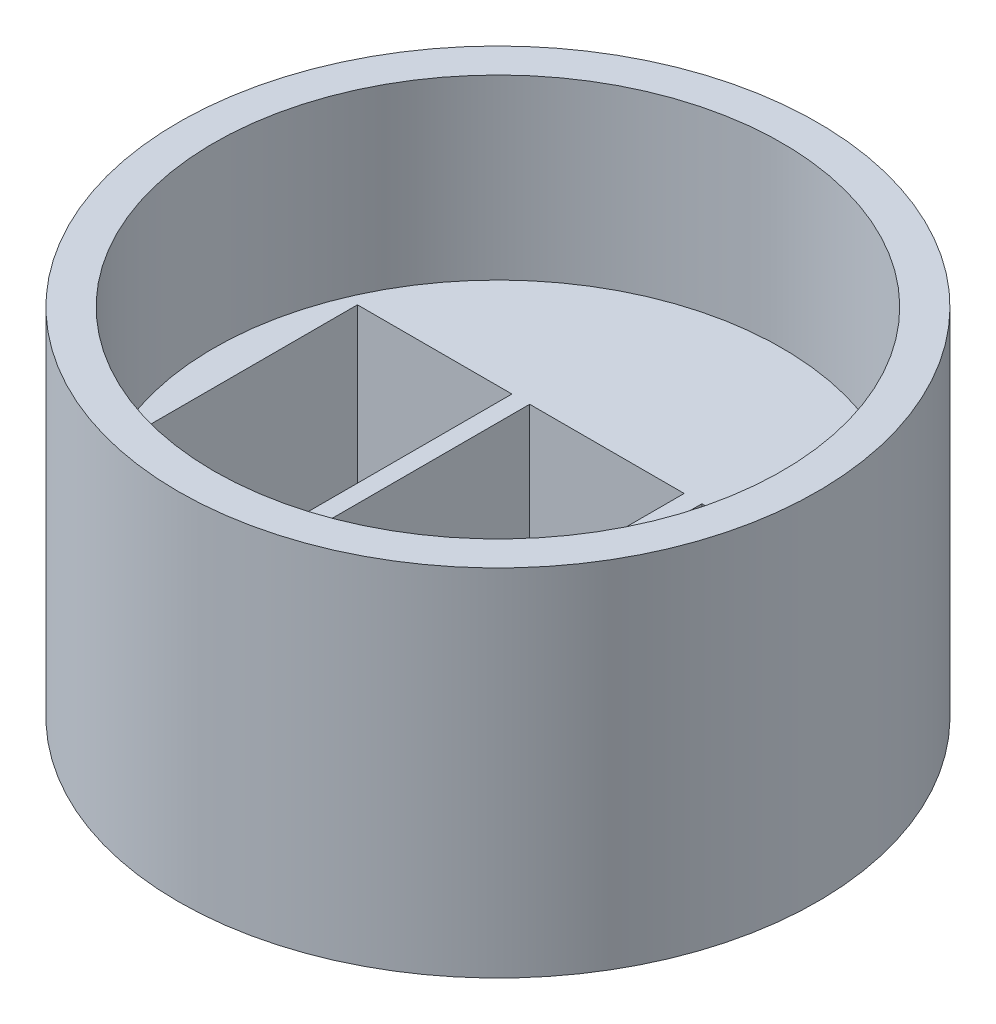
ISO-10303-21;
HEADER;
FILE_DESCRIPTION(('STEP AP214'),'2;1');
FILE_NAME('part.step','',(''),(''),'','','');
FILE_SCHEMA(('AUTOMOTIVE_DESIGN { 1 0 10303 214 1 1 1 1 }'));
ENDSEC;
DATA;
#1=APPLICATION_CONTEXT('core data for automotive mechanical design processes');
#2=APPLICATION_PROTOCOL_DEFINITION('international standard','automotive_design',2000,#1);
#3=PRODUCT_CONTEXT('',#1,'mechanical');
#4=PRODUCT('Part','Part','',(#3));
#5=PRODUCT_RELATED_PRODUCT_CATEGORY('part','',(#4));
#6=PRODUCT_DEFINITION_FORMATION('','',#4);
#7=PRODUCT_DEFINITION_CONTEXT('part definition',#1,'design');
#8=PRODUCT_DEFINITION('design','',#6,#7);
#9=PRODUCT_DEFINITION_SHAPE('','',#8);
#10=(LENGTH_UNIT() NAMED_UNIT(*) SI_UNIT(.MILLI.,.METRE.));
#11=(NAMED_UNIT(*) PLANE_ANGLE_UNIT() SI_UNIT($,.RADIAN.));
#12=(NAMED_UNIT(*) SI_UNIT($,.STERADIAN.) SOLID_ANGLE_UNIT());
#13=UNCERTAINTY_MEASURE_WITH_UNIT(LENGTH_MEASURE(1.E-05),#10,'distance_accuracy_value','');
#14=(GEOMETRIC_REPRESENTATION_CONTEXT(3) GLOBAL_UNCERTAINTY_ASSIGNED_CONTEXT((#13)) GLOBAL_UNIT_ASSIGNED_CONTEXT((#10,
#11,#12)) REPRESENTATION_CONTEXT('',''));
#15=CARTESIAN_POINT('',(0.,0.,0.));
#16=DIRECTION('',(0.,0.,1.));
#17=DIRECTION('',(1.,0.,0.));
#18=AXIS2_PLACEMENT_3D('',#15,#16,#17);
#19=CARTESIAN_POINT('',(0.,10.,0.));
#20=DIRECTION('',(0.,-1.,0.));
#21=DIRECTION('',(0.,0.,-1.));
#22=AXIS2_PLACEMENT_3D('',#19,#20,#21);
#23=CYLINDRICAL_SURFACE('',#22,9.);
#24=CARTESIAN_POINT('',(0.,10.,0.));
#25=DIRECTION('',(0.,1.,0.));
#26=DIRECTION('',(0.,0.,1.));
#27=AXIS2_PLACEMENT_3D('',#24,#25,#26);
#28=CIRCLE('',#27,9.);
#29=CARTESIAN_POINT('',(0.,10.,9.));
#30=VERTEX_POINT('',#29);
#31=EDGE_CURVE('E11',#30,#30,#28,.T.);
#32=ORIENTED_EDGE('',*,*,#31,.F.);
#33=EDGE_LOOP('',(#32));
#34=FACE_BOUND('',#33,.T.);
#35=CARTESIAN_POINT('',(0.,0.,0.));
#36=DIRECTION('',(0.,1.,0.));
#37=DIRECTION('',(0.,0.,1.));
#38=AXIS2_PLACEMENT_3D('',#35,#36,#37);
#39=CIRCLE('',#38,9.);
#40=CARTESIAN_POINT('',(0.,0.,9.));
#41=VERTEX_POINT('',#40);
#42=EDGE_CURVE('E38',#41,#41,#39,.T.);
#43=ORIENTED_EDGE('',*,*,#42,.T.);
#44=EDGE_LOOP('',(#43));
#45=FACE_BOUND('',#44,.T.);
#46=ADVANCED_FACE('F35',(#34,#45),#23,.T.);
#47=CARTESIAN_POINT('',(0.,10.,0.));
#48=DIRECTION('',(0.,1.,0.));
#49=DIRECTION('',(0.,0.,1.));
#50=AXIS2_PLACEMENT_3D('',#47,#48,#49);
#51=PLANE('',#50);
#52=CARTESIAN_POINT('',(0.,10.,0.));
#53=DIRECTION('',(0.,1.,0.));
#54=DIRECTION('',(0.,0.,1.));
#55=AXIS2_PLACEMENT_3D('',#52,#53,#54);
#56=CIRCLE('',#55,8.);
#57=CARTESIAN_POINT('',(0.,10.,8.));
#58=VERTEX_POINT('',#57);
#59=EDGE_CURVE('E217',#58,#58,#56,.T.);
#60=ORIENTED_EDGE('',*,*,#59,.F.);
#61=EDGE_LOOP('',(#60));
#62=FACE_BOUND('',#61,.T.);
#63=ORIENTED_EDGE('',*,*,#31,.T.);
#64=EDGE_LOOP('',(#63));
#65=FACE_BOUND('',#64,.T.);
#66=ADVANCED_FACE('F232',(#62,#65),#51,.T.);
#67=CARTESIAN_POINT('',(0.,0.,0.));
#68=DIRECTION('',(0.,1.,0.));
#69=DIRECTION('',(0.,0.,1.));
#70=AXIS2_PLACEMENT_3D('',#67,#68,#69);
#71=PLANE('',#70);
#72=DIRECTION('',(-1.,0.,0.));
#73=VECTOR('',#72,1.);
#74=CARTESIAN_POINT('',(7.01889440762769,0.,-3.075));
#75=LINE('',#74,#73);
#76=CARTESIAN_POINT('',(7.01889440762769,0.,-3.075));
#77=VERTEX_POINT('',#76);
#78=CARTESIAN_POINT('',(2.66889440762769,0.,-3.075));
#79=VERTEX_POINT('',#78);
#80=EDGE_CURVE('E131',#77,#79,#75,.T.);
#81=ORIENTED_EDGE('',*,*,#80,.T.);
#82=DIRECTION('',(0.,0.,1.));
#83=VECTOR('',#82,1.);
#84=CARTESIAN_POINT('',(2.66889440762769,0.,3.075));
#85=LINE('',#84,#83);
#86=CARTESIAN_POINT('',(2.66889440762769,0.,3.075));
#87=VERTEX_POINT('',#86);
#88=EDGE_CURVE('E125',#79,#87,#85,.T.);
#89=ORIENTED_EDGE('',*,*,#88,.T.);
#90=DIRECTION('',(1.,0.,0.));
#91=VECTOR('',#90,1.);
#92=CARTESIAN_POINT('',(7.01889440762769,0.,3.075));
#93=LINE('',#92,#91);
#94=CARTESIAN_POINT('',(7.01889440762769,0.,3.075));
#95=VERTEX_POINT('',#94);
#96=EDGE_CURVE('E134',#87,#95,#93,.T.);
#97=ORIENTED_EDGE('',*,*,#96,.T.);
#98=DIRECTION('',(0.,0.,-1.));
#99=VECTOR('',#98,1.);
#100=CARTESIAN_POINT('',(7.01889440762769,0.,3.075));
#101=LINE('',#100,#99);
#102=EDGE_CURVE('E49',#95,#77,#101,.T.);
#103=ORIENTED_EDGE('',*,*,#102,.T.);
#104=EDGE_LOOP('',(#81,#89,#97,#103));
#105=FACE_BOUND('',#104,.T.);
#106=DIRECTION('',(1.,0.,0.));
#107=VECTOR('',#106,1.);
#108=CARTESIAN_POINT('',(-7.03110559237231,0.,3.075));
#109=LINE('',#108,#107);
#110=CARTESIAN_POINT('',(-7.03110559237231,0.,3.075));
#111=VERTEX_POINT('',#110);
#112=CARTESIAN_POINT('',(-2.68110559237231,0.,3.075));
#113=VERTEX_POINT('',#112);
#114=EDGE_CURVE('E170',#111,#113,#109,.T.);
#115=ORIENTED_EDGE('',*,*,#114,.T.);
#116=DIRECTION('',(0.,0.,-1.));
#117=VECTOR('',#116,1.);
#118=CARTESIAN_POINT('',(-2.68110559237231,0.,-3.075));
#119=LINE('',#118,#117);
#120=CARTESIAN_POINT('',(-2.68110559237231,0.,-3.075));
#121=VERTEX_POINT('',#120);
#122=EDGE_CURVE('E160',#113,#121,#119,.T.);
#123=ORIENTED_EDGE('',*,*,#122,.T.);
#124=DIRECTION('',(-1.,0.,0.));
#125=VECTOR('',#124,1.);
#126=CARTESIAN_POINT('',(-7.03110559237231,0.,-3.075));
#127=LINE('',#126,#125);
#128=CARTESIAN_POINT('',(-7.03110559237231,0.,-3.075));
#129=VERTEX_POINT('',#128);
#130=EDGE_CURVE('E163',#121,#129,#127,.T.);
#131=ORIENTED_EDGE('',*,*,#130,.T.);
#132=DIRECTION('',(0.,0.,1.));
#133=VECTOR('',#132,1.);
#134=CARTESIAN_POINT('',(-7.03110559237231,0.,-3.075));
#135=LINE('',#134,#133);
#136=EDGE_CURVE('E167',#129,#111,#135,.T.);
#137=ORIENTED_EDGE('',*,*,#136,.T.);
#138=EDGE_LOOP('',(#115,#123,#131,#137));
#139=FACE_BOUND('',#138,.T.);
#140=DIRECTION('',(-1.,0.,0.));
#141=VECTOR('',#140,1.);
#142=CARTESIAN_POINT('',(2.16889440762769,0.,-3.075));
#143=LINE('',#142,#141);
#144=CARTESIAN_POINT('',(2.16889440762769,0.,-3.075));
#145=VERTEX_POINT('',#144);
#146=CARTESIAN_POINT('',(-2.18110559237231,0.,-3.075));
#147=VERTEX_POINT('',#146);
#148=EDGE_CURVE('E202',#145,#147,#143,.T.);
#149=ORIENTED_EDGE('',*,*,#148,.T.);
#150=DIRECTION('',(0.,0.,1.));
#151=VECTOR('',#150,1.);
#152=CARTESIAN_POINT('',(-2.18110559237231,0.,3.075));
#153=LINE('',#152,#151);
#154=CARTESIAN_POINT('',(-2.18110559237231,0.,3.075));
#155=VERTEX_POINT('',#154);
#156=EDGE_CURVE('E192',#147,#155,#153,.T.);
#157=ORIENTED_EDGE('',*,*,#156,.T.);
#158=DIRECTION('',(1.,0.,0.));
#159=VECTOR('',#158,1.);
#160=CARTESIAN_POINT('',(2.16889440762769,0.,3.075));
#161=LINE('',#160,#159);
#162=CARTESIAN_POINT('',(2.16889440762769,0.,3.075));
#163=VERTEX_POINT('',#162);
#164=EDGE_CURVE('E195',#155,#163,#161,.T.);
#165=ORIENTED_EDGE('',*,*,#164,.T.);
#166=DIRECTION('',(0.,0.,-1.));
#167=VECTOR('',#166,1.);
#168=CARTESIAN_POINT('',(2.16889440762769,0.,3.075));
#169=LINE('',#168,#167);
#170=EDGE_CURVE('E199',#163,#145,#169,.T.);
#171=ORIENTED_EDGE('',*,*,#170,.T.);
#172=EDGE_LOOP('',(#149,#157,#165,#171));
#173=FACE_BOUND('',#172,.T.);
#174=ORIENTED_EDGE('',*,*,#42,.F.);
#175=EDGE_LOOP('',(#174));
#176=FACE_BOUND('',#175,.T.);
#177=ADVANCED_FACE('F138',(#105,#139,#173,#176),#71,.F.);
#178=CARTESIAN_POINT('',(0.,5.,0.));
#179=DIRECTION('',(0.,1.,0.));
#180=DIRECTION('',(0.,0.,1.));
#181=AXIS2_PLACEMENT_3D('',#178,#179,#180);
#182=CYLINDRICAL_SURFACE('',#181,8.);
#183=CARTESIAN_POINT('',(0.,5.,0.));
#184=DIRECTION('',(0.,1.,0.));
#185=DIRECTION('',(0.,0.,1.));
#186=AXIS2_PLACEMENT_3D('',#183,#184,#185);
#187=CIRCLE('',#186,8.);
#188=CARTESIAN_POINT('',(0.,5.,8.));
#189=VERTEX_POINT('',#188);
#190=EDGE_CURVE('E224',#189,#189,#187,.T.);
#191=ORIENTED_EDGE('',*,*,#190,.F.);
#192=EDGE_LOOP('',(#191));
#193=FACE_BOUND('',#192,.T.);
#194=ORIENTED_EDGE('',*,*,#59,.T.);
#195=EDGE_LOOP('',(#194));
#196=FACE_BOUND('',#195,.T.);
#197=ADVANCED_FACE('F230',(#193,#196),#182,.F.);
#198=CARTESIAN_POINT('',(0.,5.,0.));
#199=DIRECTION('',(0.,1.,0.));
#200=DIRECTION('',(0.,0.,1.));
#201=AXIS2_PLACEMENT_3D('',#198,#199,#200);
#202=PLANE('',#201);
#203=DIRECTION('',(0.,0.,1.));
#204=VECTOR('',#203,1.);
#205=CARTESIAN_POINT('',(2.66889440762769,5.,3.075));
#206=LINE('',#205,#204);
#207=CARTESIAN_POINT('',(2.66889440762769,5.,-3.075));
#208=VERTEX_POINT('',#207);
#209=CARTESIAN_POINT('',(2.66889440762769,5.,3.075));
#210=VERTEX_POINT('',#209);
#211=EDGE_CURVE('E57',#208,#210,#206,.T.);
#212=ORIENTED_EDGE('',*,*,#211,.F.);
#213=DIRECTION('',(-1.,0.,0.));
#214=VECTOR('',#213,1.);
#215=CARTESIAN_POINT('',(7.01889440762769,5.,-3.075));
#216=LINE('',#215,#214);
#217=CARTESIAN_POINT('',(7.01889440762769,5.,-3.075));
#218=VERTEX_POINT('',#217);
#219=EDGE_CURVE('E141',#218,#208,#216,.T.);
#220=ORIENTED_EDGE('',*,*,#219,.F.);
#221=DIRECTION('',(0.,0.,-1.));
#222=VECTOR('',#221,1.);
#223=CARTESIAN_POINT('',(7.01889440762769,5.,3.075));
#224=LINE('',#223,#222);
#225=CARTESIAN_POINT('',(7.01889440762769,5.,3.075));
#226=VERTEX_POINT('',#225);
#227=EDGE_CURVE('E144',#226,#218,#224,.T.);
#228=ORIENTED_EDGE('',*,*,#227,.F.);
#229=DIRECTION('',(1.,0.,0.));
#230=VECTOR('',#229,1.);
#231=CARTESIAN_POINT('',(7.01889440762769,5.,3.075));
#232=LINE('',#231,#230);
#233=EDGE_CURVE('E150',#210,#226,#232,.T.);
#234=ORIENTED_EDGE('',*,*,#233,.F.);
#235=EDGE_LOOP('',(#212,#220,#228,#234));
#236=FACE_BOUND('',#235,.T.);
#237=DIRECTION('',(0.,0.,-1.));
#238=VECTOR('',#237,1.);
#239=CARTESIAN_POINT('',(-2.68110559237231,5.,-3.075));
#240=LINE('',#239,#238);
#241=CARTESIAN_POINT('',(-2.68110559237231,5.,3.075));
#242=VERTEX_POINT('',#241);
#243=CARTESIAN_POINT('',(-2.68110559237231,5.,-3.075));
#244=VERTEX_POINT('',#243);
#245=EDGE_CURVE('E156',#242,#244,#240,.T.);
#246=ORIENTED_EDGE('',*,*,#245,.F.);
#247=DIRECTION('',(1.,0.,0.));
#248=VECTOR('',#247,1.);
#249=CARTESIAN_POINT('',(-7.03110559237231,5.,3.075));
#250=LINE('',#249,#248);
#251=CARTESIAN_POINT('',(-7.03110559237231,5.,3.075));
#252=VERTEX_POINT('',#251);
#253=EDGE_CURVE('E164',#252,#242,#250,.T.);
#254=ORIENTED_EDGE('',*,*,#253,.F.);
#255=DIRECTION('',(0.,0.,1.));
#256=VECTOR('',#255,1.);
#257=CARTESIAN_POINT('',(-7.03110559237231,5.,-3.075));
#258=LINE('',#257,#256);
#259=CARTESIAN_POINT('',(-7.03110559237231,5.,-3.075));
#260=VERTEX_POINT('',#259);
#261=EDGE_CURVE('E178',#260,#252,#258,.T.);
#262=ORIENTED_EDGE('',*,*,#261,.F.);
#263=DIRECTION('',(-1.,0.,0.));
#264=VECTOR('',#263,1.);
#265=CARTESIAN_POINT('',(-7.03110559237231,5.,-3.075));
#266=LINE('',#265,#264);
#267=EDGE_CURVE('E175',#244,#260,#266,.T.);
#268=ORIENTED_EDGE('',*,*,#267,.F.);
#269=EDGE_LOOP('',(#246,#254,#262,#268));
#270=FACE_BOUND('',#269,.T.);
#271=DIRECTION('',(0.,0.,1.));
#272=VECTOR('',#271,1.);
#273=CARTESIAN_POINT('',(-2.18110559237231,5.,3.075));
#274=LINE('',#273,#272);
#275=CARTESIAN_POINT('',(-2.18110559237231,5.,-3.075));
#276=VERTEX_POINT('',#275);
#277=CARTESIAN_POINT('',(-2.18110559237231,5.,3.075));
#278=VERTEX_POINT('',#277);
#279=EDGE_CURVE('E185',#276,#278,#274,.T.);
#280=ORIENTED_EDGE('',*,*,#279,.F.);
#281=DIRECTION('',(-1.,0.,0.));
#282=VECTOR('',#281,1.);
#283=CARTESIAN_POINT('',(2.16889440762769,5.,-3.075));
#284=LINE('',#283,#282);
#285=CARTESIAN_POINT('',(2.16889440762769,5.,-3.075));
#286=VERTEX_POINT('',#285);
#287=EDGE_CURVE('E196',#286,#276,#284,.T.);
#288=ORIENTED_EDGE('',*,*,#287,.F.);
#289=DIRECTION('',(0.,0.,-1.));
#290=VECTOR('',#289,1.);
#291=CARTESIAN_POINT('',(2.16889440762769,5.,3.075));
#292=LINE('',#291,#290);
#293=CARTESIAN_POINT('',(2.16889440762769,5.,3.075));
#294=VERTEX_POINT('',#293);
#295=EDGE_CURVE('E210',#294,#286,#292,.T.);
#296=ORIENTED_EDGE('',*,*,#295,.F.);
#297=DIRECTION('',(1.,0.,0.));
#298=VECTOR('',#297,1.);
#299=CARTESIAN_POINT('',(2.16889440762769,5.,3.075));
#300=LINE('',#299,#298);
#301=EDGE_CURVE('E207',#278,#294,#300,.T.);
#302=ORIENTED_EDGE('',*,*,#301,.F.);
#303=EDGE_LOOP('',(#280,#288,#296,#302));
#304=FACE_BOUND('',#303,.T.);
#305=ORIENTED_EDGE('',*,*,#190,.T.);
#306=EDGE_LOOP('',(#305));
#307=FACE_BOUND('',#306,.T.);
#308=ADVANCED_FACE('F247',(#236,#270,#304,#307),#202,.T.);
#309=CARTESIAN_POINT('',(-2.18110559237231,0.,3.075));
#310=DIRECTION('',(-1.,0.,0.));
#311=DIRECTION('',(0.,0.,1.));
#312=AXIS2_PLACEMENT_3D('',#309,#310,#311);
#313=PLANE('',#312);
#314=ORIENTED_EDGE('',*,*,#279,.T.);
#315=DIRECTION('',(0.,1.,0.));
#316=VECTOR('',#315,1.);
#317=CARTESIAN_POINT('',(-2.18110559237231,0.,3.075));
#318=LINE('',#317,#316);
#319=EDGE_CURVE('E205',#155,#278,#318,.T.);
#320=ORIENTED_EDGE('',*,*,#319,.F.);
#321=ORIENTED_EDGE('',*,*,#156,.F.);
#322=DIRECTION('',(0.,1.,0.));
#323=VECTOR('',#322,1.);
#324=CARTESIAN_POINT('',(-2.18110559237231,0.,-3.075));
#325=LINE('',#324,#323);
#326=EDGE_CURVE('E215',#147,#276,#325,.T.);
#327=ORIENTED_EDGE('',*,*,#326,.T.);
#328=EDGE_LOOP('',(#314,#320,#321,#327));
#329=FACE_BOUND('',#328,.T.);
#330=ADVANCED_FACE('F253',(#329),#313,.F.);
#331=CARTESIAN_POINT('',(2.16889440762769,0.,-3.075));
#332=DIRECTION('',(0.,0.,-1.));
#333=DIRECTION('',(-1.,0.,0.));
#334=AXIS2_PLACEMENT_3D('',#331,#332,#333);
#335=PLANE('',#334);
#336=ORIENTED_EDGE('',*,*,#287,.T.);
#337=ORIENTED_EDGE('',*,*,#326,.F.);
#338=ORIENTED_EDGE('',*,*,#148,.F.);
#339=DIRECTION('',(0.,1.,0.));
#340=VECTOR('',#339,1.);
#341=CARTESIAN_POINT('',(2.16889440762769,0.,-3.075));
#342=LINE('',#341,#340);
#343=EDGE_CURVE('E218',#145,#286,#342,.T.);
#344=ORIENTED_EDGE('',*,*,#343,.T.);
#345=EDGE_LOOP('',(#336,#337,#338,#344));
#346=FACE_BOUND('',#345,.T.);
#347=ADVANCED_FACE('F257',(#346),#335,.F.);
#348=CARTESIAN_POINT('',(2.16889440762769,0.,3.075));
#349=DIRECTION('',(1.,0.,0.));
#350=DIRECTION('',(0.,0.,-1.));
#351=AXIS2_PLACEMENT_3D('',#348,#349,#350);
#352=PLANE('',#351);
#353=ORIENTED_EDGE('',*,*,#295,.T.);
#354=ORIENTED_EDGE('',*,*,#343,.F.);
#355=ORIENTED_EDGE('',*,*,#170,.F.);
#356=DIRECTION('',(0.,1.,0.));
#357=VECTOR('',#356,1.);
#358=CARTESIAN_POINT('',(2.16889440762769,0.,3.075));
#359=LINE('',#358,#357);
#360=EDGE_CURVE('E220',#163,#294,#359,.T.);
#361=ORIENTED_EDGE('',*,*,#360,.T.);
#362=EDGE_LOOP('',(#353,#354,#355,#361));
#363=FACE_BOUND('',#362,.T.);
#364=ADVANCED_FACE('F263',(#363),#352,.F.);
#365=CARTESIAN_POINT('',(2.16889440762769,0.,3.075));
#366=DIRECTION('',(0.,0.,1.));
#367=DIRECTION('',(1.,0.,0.));
#368=AXIS2_PLACEMENT_3D('',#365,#366,#367);
#369=PLANE('',#368);
#370=ORIENTED_EDGE('',*,*,#301,.T.);
#371=ORIENTED_EDGE('',*,*,#360,.F.);
#372=ORIENTED_EDGE('',*,*,#164,.F.);
#373=ORIENTED_EDGE('',*,*,#319,.T.);
#374=EDGE_LOOP('',(#370,#371,#372,#373));
#375=FACE_BOUND('',#374,.T.);
#376=ADVANCED_FACE('F259',(#375),#369,.F.);
#377=CARTESIAN_POINT('',(-2.68110559237231,0.,-3.075));
#378=DIRECTION('',(1.,0.,0.));
#379=DIRECTION('',(0.,0.,-1.));
#380=AXIS2_PLACEMENT_3D('',#377,#378,#379);
#381=PLANE('',#380);
#382=ORIENTED_EDGE('',*,*,#245,.T.);
#383=DIRECTION('',(0.,1.,0.));
#384=VECTOR('',#383,1.);
#385=CARTESIAN_POINT('',(-2.68110559237231,0.,-3.075));
#386=LINE('',#385,#384);
#387=EDGE_CURVE('E173',#121,#244,#386,.T.);
#388=ORIENTED_EDGE('',*,*,#387,.F.);
#389=ORIENTED_EDGE('',*,*,#122,.F.);
#390=DIRECTION('',(0.,1.,0.));
#391=VECTOR('',#390,1.);
#392=CARTESIAN_POINT('',(-2.68110559237231,0.,3.075));
#393=LINE('',#392,#391);
#394=EDGE_CURVE('E183',#113,#242,#393,.T.);
#395=ORIENTED_EDGE('',*,*,#394,.T.);
#396=EDGE_LOOP('',(#382,#388,#389,#395));
#397=FACE_BOUND('',#396,.T.);
#398=ADVANCED_FACE('F262',(#397),#381,.F.);
#399=CARTESIAN_POINT('',(-7.03110559237231,0.,3.075));
#400=DIRECTION('',(0.,0.,1.));
#401=DIRECTION('',(1.,0.,0.));
#402=AXIS2_PLACEMENT_3D('',#399,#400,#401);
#403=PLANE('',#402);
#404=ORIENTED_EDGE('',*,*,#253,.T.);
#405=ORIENTED_EDGE('',*,*,#394,.F.);
#406=ORIENTED_EDGE('',*,*,#114,.F.);
#407=DIRECTION('',(0.,1.,0.));
#408=VECTOR('',#407,1.);
#409=CARTESIAN_POINT('',(-7.03110559237231,0.,3.075));
#410=LINE('',#409,#408);
#411=EDGE_CURVE('E186',#111,#252,#410,.T.);
#412=ORIENTED_EDGE('',*,*,#411,.T.);
#413=EDGE_LOOP('',(#404,#405,#406,#412));
#414=FACE_BOUND('',#413,.T.);
#415=ADVANCED_FACE('F273',(#414),#403,.F.);
#416=CARTESIAN_POINT('',(-7.03110559237231,0.,-3.075));
#417=DIRECTION('',(-1.,0.,0.));
#418=DIRECTION('',(0.,0.,1.));
#419=AXIS2_PLACEMENT_3D('',#416,#417,#418);
#420=PLANE('',#419);
#421=ORIENTED_EDGE('',*,*,#261,.T.);
#422=ORIENTED_EDGE('',*,*,#411,.F.);
#423=ORIENTED_EDGE('',*,*,#136,.F.);
#424=DIRECTION('',(0.,1.,0.));
#425=VECTOR('',#424,1.);
#426=CARTESIAN_POINT('',(-7.03110559237231,0.,-3.075));
#427=LINE('',#426,#425);
#428=EDGE_CURVE('E188',#129,#260,#427,.T.);
#429=ORIENTED_EDGE('',*,*,#428,.T.);
#430=EDGE_LOOP('',(#421,#422,#423,#429));
#431=FACE_BOUND('',#430,.T.);
#432=ADVANCED_FACE('F278',(#431),#420,.F.);
#433=CARTESIAN_POINT('',(-7.03110559237231,0.,-3.075));
#434=DIRECTION('',(0.,0.,-1.));
#435=DIRECTION('',(-1.,0.,0.));
#436=AXIS2_PLACEMENT_3D('',#433,#434,#435);
#437=PLANE('',#436);
#438=ORIENTED_EDGE('',*,*,#267,.T.);
#439=ORIENTED_EDGE('',*,*,#428,.F.);
#440=ORIENTED_EDGE('',*,*,#130,.F.);
#441=ORIENTED_EDGE('',*,*,#387,.T.);
#442=EDGE_LOOP('',(#438,#439,#440,#441));
#443=FACE_BOUND('',#442,.T.);
#444=ADVANCED_FACE('F275',(#443),#437,.F.);
#445=CARTESIAN_POINT('',(2.66889440762769,0.,3.075));
#446=DIRECTION('',(-1.,0.,0.));
#447=DIRECTION('',(0.,0.,1.));
#448=AXIS2_PLACEMENT_3D('',#445,#446,#447);
#449=PLANE('',#448);
#450=ORIENTED_EDGE('',*,*,#211,.T.);
#451=DIRECTION('',(0.,1.,0.));
#452=VECTOR('',#451,1.);
#453=CARTESIAN_POINT('',(2.66889440762769,0.,3.075));
#454=LINE('',#453,#452);
#455=EDGE_CURVE('E121',#87,#210,#454,.T.);
#456=ORIENTED_EDGE('',*,*,#455,.F.);
#457=ORIENTED_EDGE('',*,*,#88,.F.);
#458=DIRECTION('',(0.,1.,0.));
#459=VECTOR('',#458,1.);
#460=CARTESIAN_POINT('',(2.66889440762769,0.,-3.075));
#461=LINE('',#460,#459);
#462=EDGE_CURVE('E154',#79,#208,#461,.T.);
#463=ORIENTED_EDGE('',*,*,#462,.T.);
#464=EDGE_LOOP('',(#450,#456,#457,#463));
#465=FACE_BOUND('',#464,.T.);
#466=ADVANCED_FACE('F123',(#465),#449,.F.);
#467=CARTESIAN_POINT('',(7.01889440762769,0.,-3.075));
#468=DIRECTION('',(0.,0.,-1.));
#469=DIRECTION('',(-1.,0.,0.));
#470=AXIS2_PLACEMENT_3D('',#467,#468,#469);
#471=PLANE('',#470);
#472=ORIENTED_EDGE('',*,*,#219,.T.);
#473=ORIENTED_EDGE('',*,*,#462,.F.);
#474=ORIENTED_EDGE('',*,*,#80,.F.);
#475=DIRECTION('',(0.,1.,0.));
#476=VECTOR('',#475,1.);
#477=CARTESIAN_POINT('',(7.01889440762769,0.,-3.075));
#478=LINE('',#477,#476);
#479=EDGE_CURVE('E157',#77,#218,#478,.T.);
#480=ORIENTED_EDGE('',*,*,#479,.T.);
#481=EDGE_LOOP('',(#472,#473,#474,#480));
#482=FACE_BOUND('',#481,.T.);
#483=ADVANCED_FACE('F288',(#482),#471,.F.);
#484=CARTESIAN_POINT('',(7.01889440762769,0.,3.075));
#485=DIRECTION('',(1.,0.,0.));
#486=DIRECTION('',(0.,0.,-1.));
#487=AXIS2_PLACEMENT_3D('',#484,#485,#486);
#488=PLANE('',#487);
#489=ORIENTED_EDGE('',*,*,#227,.T.);
#490=ORIENTED_EDGE('',*,*,#479,.F.);
#491=ORIENTED_EDGE('',*,*,#102,.F.);
#492=DIRECTION('',(0.,1.,0.));
#493=VECTOR('',#492,1.);
#494=CARTESIAN_POINT('',(7.01889440762769,0.,3.075));
#495=LINE('',#494,#493);
#496=EDGE_CURVE('E130',#95,#226,#495,.T.);
#497=ORIENTED_EDGE('',*,*,#496,.T.);
#498=EDGE_LOOP('',(#489,#490,#491,#497));
#499=FACE_BOUND('',#498,.T.);
#500=ADVANCED_FACE('F291',(#499),#488,.F.);
#501=CARTESIAN_POINT('',(7.01889440762769,0.,3.075));
#502=DIRECTION('',(0.,0.,1.));
#503=DIRECTION('',(1.,0.,0.));
#504=AXIS2_PLACEMENT_3D('',#501,#502,#503);
#505=PLANE('',#504);
#506=ORIENTED_EDGE('',*,*,#233,.T.);
#507=ORIENTED_EDGE('',*,*,#496,.F.);
#508=ORIENTED_EDGE('',*,*,#96,.F.);
#509=ORIENTED_EDGE('',*,*,#455,.T.);
#510=EDGE_LOOP('',(#506,#507,#508,#509));
#511=FACE_BOUND('',#510,.T.);
#512=ADVANCED_FACE('F135',(#511),#505,.F.);
#513=CLOSED_SHELL('',(#46,#66,#177,#197,#308,#330,#347,#364,#376,#398,#415,#432,#444,#466,#483,
#500,#512));
#514=MANIFOLD_SOLID_BREP('B2',#513);
#515=ADVANCED_BREP_SHAPE_REPRESENTATION('',(#18,#514),#14);
#516=SHAPE_DEFINITION_REPRESENTATION(#9,#515);
ENDSEC;
END-ISO-10303-21;
